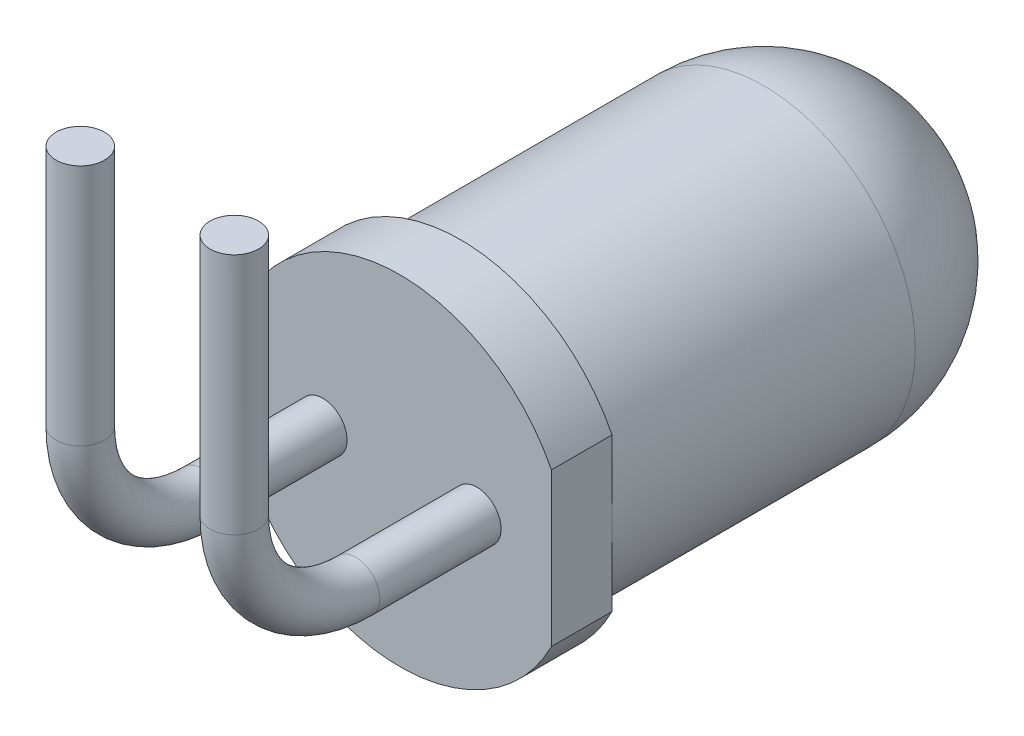
ISO-10303-21;
HEADER;
FILE_DESCRIPTION(('STEP AP214'),'2;1');
FILE_NAME('part.step','',(''),(''),'','','');
FILE_SCHEMA(('AUTOMOTIVE_DESIGN { 1 0 10303 214 1 1 1 1 }'));
ENDSEC;
DATA;
#1=APPLICATION_CONTEXT('core data for automotive mechanical design processes');
#2=APPLICATION_PROTOCOL_DEFINITION('international standard','automotive_design',2000,#1);
#3=PRODUCT_CONTEXT('',#1,'mechanical');
#4=PRODUCT('Part','Part','',(#3));
#5=PRODUCT_RELATED_PRODUCT_CATEGORY('part','',(#4));
#6=PRODUCT_DEFINITION_FORMATION('','',#4);
#7=PRODUCT_DEFINITION_CONTEXT('part definition',#1,'design');
#8=PRODUCT_DEFINITION('design','',#6,#7);
#9=PRODUCT_DEFINITION_SHAPE('','',#8);
#10=(LENGTH_UNIT() NAMED_UNIT(*) SI_UNIT(.MILLI.,.METRE.));
#11=(NAMED_UNIT(*) PLANE_ANGLE_UNIT() SI_UNIT($,.RADIAN.));
#12=(NAMED_UNIT(*) SI_UNIT($,.STERADIAN.) SOLID_ANGLE_UNIT());
#13=UNCERTAINTY_MEASURE_WITH_UNIT(LENGTH_MEASURE(1.E-05),#10,'distance_accuracy_value','');
#14=(GEOMETRIC_REPRESENTATION_CONTEXT(3) GLOBAL_UNCERTAINTY_ASSIGNED_CONTEXT((#13)) GLOBAL_UNIT_ASSIGNED_CONTEXT((#10,
#11,#12)) REPRESENTATION_CONTEXT('',''));
#15=CARTESIAN_POINT('',(0.,0.,0.));
#16=DIRECTION('',(0.,0.,1.));
#17=DIRECTION('',(1.,0.,0.));
#18=AXIS2_PLACEMENT_3D('',#15,#16,#17);
#19=CARTESIAN_POINT('',(0.,0.,8.5));
#20=DIRECTION('',(0.,0.,1.));
#21=DIRECTION('',(1.,0.,0.));
#22=AXIS2_PLACEMENT_3D('',#19,#20,#21);
#23=PLANE('',#22);
#24=CARTESIAN_POINT('',(-1.27,0.,8.49999999999999));
#25=DIRECTION('',(0.,0.,1.));
#26=DIRECTION('',(1.,0.,0.));
#27=AXIS2_PLACEMENT_3D('',#24,#25,#26);
#28=CIRCLE('',#27,0.4);
#29=CARTESIAN_POINT('',(-0.87,0.,8.49999999999999));
#30=VERTEX_POINT('',#29);
#31=EDGE_CURVE('E11',#30,#30,#28,.T.);
#32=ORIENTED_EDGE('',*,*,#31,.F.);
#33=EDGE_LOOP('',(#32));
#34=FACE_BOUND('',#33,.T.);
#35=DIRECTION('',(0.,1.,0.));
#36=VECTOR('',#35,1.);
#37=CARTESIAN_POINT('',(2.5,1.2609520212918,8.50000000000001));
#38=LINE('',#37,#36);
#39=CARTESIAN_POINT('',(2.5,-1.26095202129185,8.5));
#40=VERTEX_POINT('',#39);
#41=CARTESIAN_POINT('',(2.5,1.2609520212918,8.50000000000001));
#42=VERTEX_POINT('',#41);
#43=EDGE_CURVE('E82',#40,#42,#38,.T.);
#44=ORIENTED_EDGE('',*,*,#43,.T.);
#45=CARTESIAN_POINT('',(0.,0.,8.5));
#46=DIRECTION('',(0.,0.,1.));
#47=DIRECTION('',(1.,0.,0.));
#48=AXIS2_PLACEMENT_3D('',#45,#46,#47);
#49=CIRCLE('',#48,2.8);
#50=EDGE_CURVE('E72',#42,#40,#49,.T.);
#51=ORIENTED_EDGE('',*,*,#50,.T.);
#52=EDGE_LOOP('',(#44,#51));
#53=FACE_BOUND('',#52,.T.);
#54=CARTESIAN_POINT('',(1.27,0.,8.50000000000001));
#55=DIRECTION('',(0.,0.,1.));
#56=DIRECTION('',(1.,0.,0.));
#57=AXIS2_PLACEMENT_3D('',#54,#55,#56);
#58=CIRCLE('',#57,0.4);
#59=CARTESIAN_POINT('',(1.67,0.,8.50000000000001));
#60=VERTEX_POINT('',#59);
#61=EDGE_CURVE('E221',#60,#60,#58,.T.);
#62=ORIENTED_EDGE('',*,*,#61,.F.);
#63=EDGE_LOOP('',(#62));
#64=FACE_BOUND('',#63,.T.);
#65=ADVANCED_FACE('F36',(#34,#53,#64),#23,.T.);
#66=CARTESIAN_POINT('',(0.,0.,8.5));
#67=DIRECTION('',(0.,0.,-1.));
#68=DIRECTION('',(-1.,0.,0.));
#69=AXIS2_PLACEMENT_3D('',#66,#67,#68);
#70=CYLINDRICAL_SURFACE('',#69,2.5);
#71=CARTESIAN_POINT('',(0.,0.,2.5));
#72=DIRECTION('',(0.,0.,-1.));
#73=DIRECTION('',(-1.,0.,0.));
#74=AXIS2_PLACEMENT_3D('',#71,#72,#73);
#75=CIRCLE('',#74,2.5);
#76=CARTESIAN_POINT('',(-2.5,0.,2.5));
#77=VERTEX_POINT('',#76);
#78=EDGE_CURVE('E44',#77,#77,#75,.F.);
#79=ORIENTED_EDGE('',*,*,#78,.T.);
#80=EDGE_LOOP('',(#79));
#81=FACE_BOUND('',#80,.T.);
#82=CARTESIAN_POINT('',(0.,0.,7.5));
#83=DIRECTION('',(0.,0.,1.));
#84=DIRECTION('',(1.,0.,0.));
#85=AXIS2_PLACEMENT_3D('',#82,#83,#84);
#86=CIRCLE('',#85,2.5);
#87=CARTESIAN_POINT('',(2.5,0.,7.50000000000001));
#88=VERTEX_POINT('',#87);
#89=EDGE_CURVE('E49',#88,#88,#86,.T.);
#90=ORIENTED_EDGE('',*,*,#89,.F.);
#91=EDGE_LOOP('',(#90));
#92=FACE_BOUND('',#91,.T.);
#93=ADVANCED_FACE('F38',(#81,#92),#70,.T.);
#94=CARTESIAN_POINT('',(0.,0.,7.5));
#95=DIRECTION('',(0.,0.,1.));
#96=DIRECTION('',(1.,0.,0.));
#97=AXIS2_PLACEMENT_3D('',#94,#95,#96);
#98=PLANE('',#97);
#99=DIRECTION('',(0.,1.,0.));
#100=VECTOR('',#99,1.);
#101=CARTESIAN_POINT('',(2.5,1.2609520212918,7.50000000000001));
#102=LINE('',#101,#100);
#103=CARTESIAN_POINT('',(2.5,1.2609520212918,7.50000000000001));
#104=VERTEX_POINT('',#103);
#105=EDGE_CURVE('E56',#88,#104,#102,.T.);
#106=ORIENTED_EDGE('',*,*,#105,.F.);
#107=ORIENTED_EDGE('',*,*,#89,.T.);
#108=CARTESIAN_POINT('',(2.5,-1.26095202129186,7.50000000000003));
#109=VERTEX_POINT('',#108);
#110=EDGE_CURVE('E78',#109,#88,#102,.T.);
#111=ORIENTED_EDGE('',*,*,#110,.F.);
#112=CARTESIAN_POINT('',(0.,0.,7.5));
#113=DIRECTION('',(0.,0.,1.));
#114=DIRECTION('',(1.,0.,0.));
#115=AXIS2_PLACEMENT_3D('',#112,#113,#114);
#116=CIRCLE('',#115,2.8);
#117=EDGE_CURVE('E74',#104,#109,#116,.T.);
#118=ORIENTED_EDGE('',*,*,#117,.F.);
#119=EDGE_LOOP('',(#106,#107,#111,#118));
#120=FACE_BOUND('',#119,.T.);
#121=ADVANCED_FACE('F114',(#120),#98,.F.);
#122=CARTESIAN_POINT('',(2.5,1.2609520212918,7.50000000000001));
#123=DIRECTION('',(1.,0.,0.));
#124=DIRECTION('',(0.,0.,-1.));
#125=AXIS2_PLACEMENT_3D('',#122,#123,#124);
#126=PLANE('',#125);
#127=ORIENTED_EDGE('',*,*,#110,.T.);
#128=ORIENTED_EDGE('',*,*,#105,.T.);
#129=DIRECTION('',(0.,0.,1.));
#130=VECTOR('',#129,1.);
#131=CARTESIAN_POINT('',(2.5,1.2609520212918,7.50000000000001));
#132=LINE('',#131,#130);
#133=EDGE_CURVE('E77',#104,#42,#132,.T.);
#134=ORIENTED_EDGE('',*,*,#133,.T.);
#135=ORIENTED_EDGE('',*,*,#43,.F.);
#136=DIRECTION('',(0.,0.,1.));
#137=VECTOR('',#136,1.);
#138=CARTESIAN_POINT('',(2.5,-1.26095202129186,7.50000000000003));
#139=LINE('',#138,#137);
#140=EDGE_CURVE('E69',#109,#40,#139,.T.);
#141=ORIENTED_EDGE('',*,*,#140,.F.);
#142=EDGE_LOOP('',(#127,#128,#134,#135,#141));
#143=FACE_BOUND('',#142,.T.);
#144=ADVANCED_FACE('F85',(#143),#126,.T.);
#145=CARTESIAN_POINT('',(0.,0.,7.5));
#146=DIRECTION('',(0.,0.,1.));
#147=DIRECTION('',(1.,0.,0.));
#148=AXIS2_PLACEMENT_3D('',#145,#146,#147);
#149=CYLINDRICAL_SURFACE('',#148,2.8);
#150=ORIENTED_EDGE('',*,*,#50,.F.);
#151=ORIENTED_EDGE('',*,*,#133,.F.);
#152=ORIENTED_EDGE('',*,*,#117,.T.);
#153=ORIENTED_EDGE('',*,*,#140,.T.);
#154=EDGE_LOOP('',(#150,#151,#152,#153));
#155=FACE_BOUND('',#154,.T.);
#156=ADVANCED_FACE('F71',(#155),#149,.T.);
#157=CARTESIAN_POINT('',(0.,0.,2.5));
#158=DIRECTION('',(0.,0.,1.));
#159=DIRECTION('',(1.,0.,0.));
#160=AXIS2_PLACEMENT_3D('',#157,#158,#159);
#161=SPHERICAL_SURFACE('',#160,2.5);
#162=ORIENTED_EDGE('',*,*,#78,.F.);
#163=EDGE_LOOP('',(#162));
#164=FACE_BOUND('',#163,.T.);
#165=ADVANCED_FACE('F96',(#164),#161,.T.);
#166=CARTESIAN_POINT('',(1.26999999999999,2.,12.5));
#167=DIRECTION('',(0.,1.,0.));
#168=DIRECTION('',(0.,0.,1.));
#169=AXIS2_PLACEMENT_3D('',#166,#167,#168);
#170=CYLINDRICAL_SURFACE('',#169,0.4);
#171=CARTESIAN_POINT('',(1.26999999999999,2.,12.5));
#172=DIRECTION('',(0.,1.,0.));
#173=DIRECTION('',(1.,0.,0.));
#174=AXIS2_PLACEMENT_3D('',#171,#172,#173);
#175=CIRCLE('',#174,0.4);
#176=CARTESIAN_POINT('',(1.26999999999999,2.00000000000001,12.9));
#177=VERTEX_POINT('',#176);
#178=EDGE_CURVE('E234',#177,#177,#175,.T.);
#179=ORIENTED_EDGE('',*,*,#178,.T.);
#180=EDGE_LOOP('',(#179));
#181=FACE_BOUND('',#180,.T.);
#182=CARTESIAN_POINT('',(1.26999999999996,5.99999999999999,12.5));
#183=DIRECTION('',(0.,1.,0.));
#184=DIRECTION('',(1.,0.,0.));
#185=AXIS2_PLACEMENT_3D('',#182,#183,#184);
#186=CIRCLE('',#185,0.4);
#187=CARTESIAN_POINT('',(1.66999999999996,5.99999999999999,12.5));
#188=VERTEX_POINT('',#187);
#189=EDGE_CURVE('E83',#188,#188,#186,.T.);
#190=ORIENTED_EDGE('',*,*,#189,.F.);
#191=EDGE_LOOP('',(#190));
#192=FACE_BOUND('',#191,.T.);
#193=ADVANCED_FACE('F98',(#181,#192),#170,.T.);
#194=CARTESIAN_POINT('',(1.27,1.99999999999995,10.5));
#195=DIRECTION('',(-1.,0.,0.));
#196=DIRECTION('',(0.,0.,1.));
#197=AXIS2_PLACEMENT_3D('',#194,#195,#196);
#198=TOROIDAL_SURFACE('',#197,2.,0.4);
#199=CARTESIAN_POINT('',(1.27,0.,10.5));
#200=DIRECTION('',(0.,0.,1.));
#201=DIRECTION('',(1.,0.,0.));
#202=AXIS2_PLACEMENT_3D('',#199,#200,#201);
#203=CIRCLE('',#202,0.4);
#204=CARTESIAN_POINT('',(1.27,-0.400000000000047,10.5));
#205=VERTEX_POINT('',#204);
#206=EDGE_CURVE('E225',#205,#205,#203,.T.);
#207=CARTESIAN_POINT('',(1.27,1.99999999999995,10.5));
#208=DIRECTION('',(-1.,0.,0.));
#209=DIRECTION('',(0.,0.,1.));
#210=AXIS2_PLACEMENT_3D('',#207,#208,#209);
#211=CIRCLE('',#210,2.4);
#212=EDGE_CURVE('',#205,#177,#211,.T.);
#213=ORIENTED_EDGE('',*,*,#206,.T.);
#214=ORIENTED_EDGE('',*,*,#178,.F.);
#215=ORIENTED_EDGE('',*,*,#212,.T.);
#216=ORIENTED_EDGE('',*,*,#212,.F.);
#217=EDGE_LOOP('',(#213,#215,#214,#216));
#218=FACE_BOUND('',#217,.T.);
#219=ADVANCED_FACE('F104',(#218),#198,.T.);
#220=CARTESIAN_POINT('',(1.27,0.,10.5));
#221=DIRECTION('',(0.,0.,-1.));
#222=DIRECTION('',(0.,1.,0.));
#223=AXIS2_PLACEMENT_3D('',#220,#221,#222);
#224=CYLINDRICAL_SURFACE('',#223,0.4);
#225=ORIENTED_EDGE('',*,*,#206,.F.);
#226=EDGE_LOOP('',(#225));
#227=FACE_BOUND('',#226,.T.);
#228=ORIENTED_EDGE('',*,*,#61,.T.);
#229=EDGE_LOOP('',(#228));
#230=FACE_BOUND('',#229,.T.);
#231=ADVANCED_FACE('F153',(#227,#230),#224,.T.);
#232=CARTESIAN_POINT('',(1.26999999999996,5.99999999999999,12.5));
#233=DIRECTION('',(0.,1.,0.));
#234=DIRECTION('',(1.,0.,0.));
#235=AXIS2_PLACEMENT_3D('',#232,#233,#234);
#236=PLANE('',#235);
#237=ORIENTED_EDGE('',*,*,#189,.T.);
#238=EDGE_LOOP('',(#237));
#239=FACE_BOUND('',#238,.T.);
#240=ADVANCED_FACE('F163',(#239),#236,.T.);
#241=CARTESIAN_POINT('',(-1.27,2.,12.5));
#242=DIRECTION('',(0.,1.,0.));
#243=DIRECTION('',(0.,0.,1.));
#244=AXIS2_PLACEMENT_3D('',#241,#242,#243);
#245=CYLINDRICAL_SURFACE('',#244,0.4);
#246=CARTESIAN_POINT('',(-1.27,2.,12.5));
#247=DIRECTION('',(0.,-1.,0.));
#248=DIRECTION('',(-1.,0.,0.));
#249=AXIS2_PLACEMENT_3D('',#246,#247,#248);
#250=CIRCLE('',#249,0.4);
#251=CARTESIAN_POINT('',(-1.27,2.00000000000001,12.9));
#252=VERTEX_POINT('',#251);
#253=EDGE_CURVE('E222',#252,#252,#250,.T.);
#254=ORIENTED_EDGE('',*,*,#253,.F.);
#255=EDGE_LOOP('',(#254));
#256=FACE_BOUND('',#255,.T.);
#257=CARTESIAN_POINT('',(-1.27000000000004,5.99999999999999,12.5));
#258=DIRECTION('',(0.,-1.,0.));
#259=DIRECTION('',(-1.,0.,0.));
#260=AXIS2_PLACEMENT_3D('',#257,#258,#259);
#261=CIRCLE('',#260,0.4);
#262=CARTESIAN_POINT('',(-1.67000000000004,5.99999999999999,12.5));
#263=VERTEX_POINT('',#262);
#264=EDGE_CURVE('E219',#263,#263,#261,.T.);
#265=ORIENTED_EDGE('',*,*,#264,.T.);
#266=EDGE_LOOP('',(#265));
#267=FACE_BOUND('',#266,.T.);
#268=ADVANCED_FACE('F173',(#256,#267),#245,.T.);
#269=CARTESIAN_POINT('',(-1.27,1.99999999999995,10.5));
#270=DIRECTION('',(-1.,0.,0.));
#271=DIRECTION('',(0.,0.,1.));
#272=AXIS2_PLACEMENT_3D('',#269,#270,#271);
#273=TOROIDAL_SURFACE('',#272,2.,0.4);
#274=CARTESIAN_POINT('',(-1.27,0.,10.5));
#275=DIRECTION('',(0.,0.,-1.));
#276=DIRECTION('',(-1.,0.,0.));
#277=AXIS2_PLACEMENT_3D('',#274,#275,#276);
#278=CIRCLE('',#277,0.4);
#279=CARTESIAN_POINT('',(-1.27,-0.400000000000047,10.5));
#280=VERTEX_POINT('',#279);
#281=EDGE_CURVE('E228',#280,#280,#278,.T.);
#282=CARTESIAN_POINT('',(-1.27,1.99999999999995,10.5));
#283=DIRECTION('',(-1.,0.,0.));
#284=DIRECTION('',(0.,0.,1.));
#285=AXIS2_PLACEMENT_3D('',#282,#283,#284);
#286=CIRCLE('',#285,2.4);
#287=EDGE_CURVE('',#280,#252,#286,.T.);
#288=ORIENTED_EDGE('',*,*,#281,.F.);
#289=ORIENTED_EDGE('',*,*,#253,.T.);
#290=ORIENTED_EDGE('',*,*,#287,.T.);
#291=ORIENTED_EDGE('',*,*,#287,.F.);
#292=EDGE_LOOP('',(#288,#290,#289,#291));
#293=FACE_BOUND('',#292,.T.);
#294=ADVANCED_FACE('F183',(#293),#273,.T.);
#295=CARTESIAN_POINT('',(-1.27,0.,10.5));
#296=DIRECTION('',(0.,0.,-1.));
#297=DIRECTION('',(0.,1.,0.));
#298=AXIS2_PLACEMENT_3D('',#295,#296,#297);
#299=CYLINDRICAL_SURFACE('',#298,0.4);
#300=ORIENTED_EDGE('',*,*,#281,.T.);
#301=EDGE_LOOP('',(#300));
#302=FACE_BOUND('',#301,.T.);
#303=ORIENTED_EDGE('',*,*,#31,.T.);
#304=EDGE_LOOP('',(#303));
#305=FACE_BOUND('',#304,.T.);
#306=ADVANCED_FACE('F193',(#302,#305),#299,.T.);
#307=CARTESIAN_POINT('',(-1.27000000000004,5.99999999999999,12.5));
#308=DIRECTION('',(0.,1.,0.));
#309=DIRECTION('',(-1.,0.,0.));
#310=AXIS2_PLACEMENT_3D('',#307,#308,#309);
#311=PLANE('',#310);
#312=ORIENTED_EDGE('',*,*,#264,.F.);
#313=EDGE_LOOP('',(#312));
#314=FACE_BOUND('',#313,.T.);
#315=ADVANCED_FACE('F203',(#314),#311,.T.);
#316=CLOSED_SHELL('',(#65,#93,#121,#144,#156,#165,#193,#219,#231,#240,#268,#294,#306,#315));
#317=MANIFOLD_SOLID_BREP('B2',#316);
#318=ADVANCED_BREP_SHAPE_REPRESENTATION('',(#18,#317),#14);
#319=SHAPE_DEFINITION_REPRESENTATION(#9,#318);
ENDSEC;
END-ISO-10303-21;
